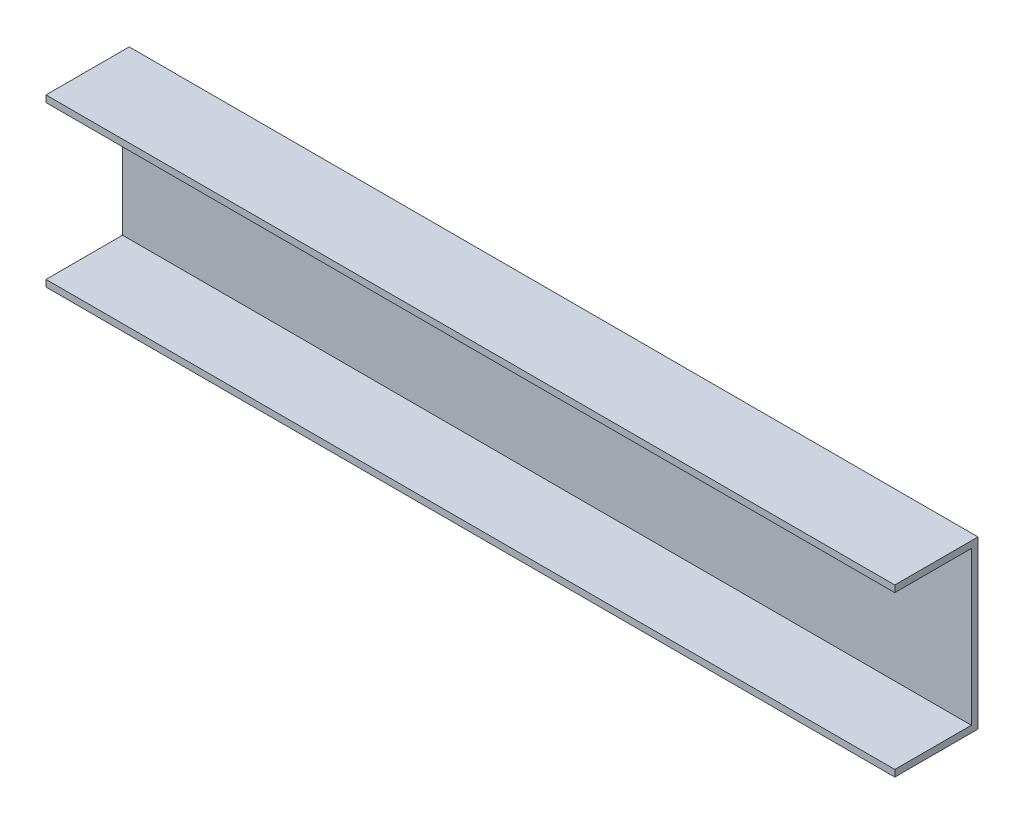
ISO-10303-21;
HEADER;
FILE_DESCRIPTION(('STEP AP214'),'2;1');
FILE_NAME('part.step','',(''),(''),'','','');
FILE_SCHEMA(('AUTOMOTIVE_DESIGN { 1 0 10303 214 1 1 1 1 }'));
ENDSEC;
DATA;
#1=APPLICATION_CONTEXT('core data for automotive mechanical design processes');
#2=APPLICATION_PROTOCOL_DEFINITION('international standard','automotive_design',2000,#1);
#3=PRODUCT_CONTEXT('',#1,'mechanical');
#4=PRODUCT('Part','Part','',(#3));
#5=PRODUCT_RELATED_PRODUCT_CATEGORY('part','',(#4));
#6=PRODUCT_DEFINITION_FORMATION('','',#4);
#7=PRODUCT_DEFINITION_CONTEXT('part definition',#1,'design');
#8=PRODUCT_DEFINITION('design','',#6,#7);
#9=PRODUCT_DEFINITION_SHAPE('','',#8);
#10=(LENGTH_UNIT() NAMED_UNIT(*) SI_UNIT(.MILLI.,.METRE.));
#11=(NAMED_UNIT(*) PLANE_ANGLE_UNIT() SI_UNIT($,.RADIAN.));
#12=(NAMED_UNIT(*) SI_UNIT($,.STERADIAN.) SOLID_ANGLE_UNIT());
#13=UNCERTAINTY_MEASURE_WITH_UNIT(LENGTH_MEASURE(1.E-05),#10,'distance_accuracy_value','');
#14=(GEOMETRIC_REPRESENTATION_CONTEXT(3) GLOBAL_UNCERTAINTY_ASSIGNED_CONTEXT((#13)) GLOBAL_UNIT_ASSIGNED_CONTEXT((#10,
#11,#12)) REPRESENTATION_CONTEXT('',''));
#15=CARTESIAN_POINT('',(0.,0.,0.));
#16=DIRECTION('',(0.,0.,1.));
#17=DIRECTION('',(1.,0.,0.));
#18=AXIS2_PLACEMENT_3D('',#15,#16,#17);
#19=CARTESIAN_POINT('',(175.,26.3779527559055,0.));
#20=DIRECTION('',(0.,0.,-1.));
#21=DIRECTION('',(0.,1.,0.));
#22=AXIS2_PLACEMENT_3D('',#19,#20,#21);
#23=PLANE('',#22);
#24=DIRECTION('',(-1.,0.,0.));
#25=VECTOR('',#24,1.);
#26=CARTESIAN_POINT('',(175.,26.3779527559055,0.));
#27=LINE('',#26,#25);
#28=CARTESIAN_POINT('',(175.,26.3779527559055,0.));
#29=VERTEX_POINT('',#28);
#30=CARTESIAN_POINT('',(-80.,26.3779527559055,0.));
#31=VERTEX_POINT('',#30);
#32=EDGE_CURVE('E105',#29,#31,#27,.T.);
#33=ORIENTED_EDGE('',*,*,#32,.T.);
#34=DIRECTION('',(0.,1.,0.));
#35=VECTOR('',#34,1.);
#36=CARTESIAN_POINT('',(-80.,24.3779527559055,0.));
#37=LINE('',#36,#35);
#38=CARTESIAN_POINT('',(-80.,24.3779527559055,0.));
#39=VERTEX_POINT('',#38);
#40=EDGE_CURVE('E109',#39,#31,#37,.T.);
#41=ORIENTED_EDGE('',*,*,#40,.F.);
#42=DIRECTION('',(-1.,0.,0.));
#43=VECTOR('',#42,1.);
#44=CARTESIAN_POINT('',(175.,24.3779527559055,0.));
#45=LINE('',#44,#43);
#46=CARTESIAN_POINT('',(175.,24.3779527559055,0.));
#47=VERTEX_POINT('',#46);
#48=EDGE_CURVE('E11',#47,#39,#45,.T.);
#49=ORIENTED_EDGE('',*,*,#48,.F.);
#50=DIRECTION('',(0.,-1.,0.));
#51=VECTOR('',#50,1.);
#52=CARTESIAN_POINT('',(175.,26.3779527559055,0.));
#53=LINE('',#52,#51);
#54=EDGE_CURVE('E110',#29,#47,#53,.T.);
#55=ORIENTED_EDGE('',*,*,#54,.F.);
#56=EDGE_LOOP('',(#33,#41,#49,#55));
#57=FACE_BOUND('',#56,.T.);
#58=ADVANCED_FACE('F41',(#57),#23,.F.);
#59=CARTESIAN_POINT('',(175.,24.3779527559055,0.));
#60=DIRECTION('',(0.,1.,0.));
#61=DIRECTION('',(0.,0.,1.));
#62=AXIS2_PLACEMENT_3D('',#59,#60,#61);
#63=PLANE('',#62);
#64=ORIENTED_EDGE('',*,*,#48,.T.);
#65=DIRECTION('',(0.,0.,1.));
#66=VECTOR('',#65,1.);
#67=CARTESIAN_POINT('',(-80.,24.3779527559055,-23.));
#68=LINE('',#67,#66);
#69=CARTESIAN_POINT('',(-80.,24.3779527559055,-23.));
#70=VERTEX_POINT('',#69);
#71=EDGE_CURVE('E128',#70,#39,#68,.T.);
#72=ORIENTED_EDGE('',*,*,#71,.F.);
#73=DIRECTION('',(-1.,0.,0.));
#74=VECTOR('',#73,1.);
#75=CARTESIAN_POINT('',(175.,24.3779527559055,-23.));
#76=LINE('',#75,#74);
#77=CARTESIAN_POINT('',(175.,24.3779527559055,-23.));
#78=VERTEX_POINT('',#77);
#79=EDGE_CURVE('E49',#78,#70,#76,.T.);
#80=ORIENTED_EDGE('',*,*,#79,.F.);
#81=DIRECTION('',(0.,0.,-1.));
#82=VECTOR('',#81,1.);
#83=CARTESIAN_POINT('',(175.,24.3779527559055,0.));
#84=LINE('',#83,#82);
#85=EDGE_CURVE('E161',#47,#78,#84,.T.);
#86=ORIENTED_EDGE('',*,*,#85,.F.);
#87=EDGE_LOOP('',(#64,#72,#80,#86));
#88=FACE_BOUND('',#87,.T.);
#89=ADVANCED_FACE('F202',(#88),#63,.F.);
#90=CARTESIAN_POINT('',(175.,24.3779527559055,-23.));
#91=DIRECTION('',(0.,0.,-1.));
#92=DIRECTION('',(0.,1.,0.));
#93=AXIS2_PLACEMENT_3D('',#90,#91,#92);
#94=PLANE('',#93);
#95=CARTESIAN_POINT('',(30.,6.37795275590551,-23.));
#96=DIRECTION('',(0.,0.,-1.));
#97=DIRECTION('',(0.,1.,0.));
#98=AXIS2_PLACEMENT_3D('',#95,#96,#97);
#99=CIRCLE('',#98,2.55);
#100=CARTESIAN_POINT('',(30.,8.92795275590551,-23.));
#101=VERTEX_POINT('',#100);
#102=EDGE_CURVE('E155',#101,#101,#99,.T.);
#103=ORIENTED_EDGE('',*,*,#102,.T.);
#104=EDGE_LOOP('',(#103));
#105=FACE_BOUND('',#104,.T.);
#106=ORIENTED_EDGE('',*,*,#79,.T.);
#107=DIRECTION('',(0.,1.,0.));
#108=VECTOR('',#107,1.);
#109=CARTESIAN_POINT('',(-80.,-21.6220472440945,-23.));
#110=LINE('',#109,#108);
#111=CARTESIAN_POINT('',(-80.,-21.6220472440945,-23.));
#112=VERTEX_POINT('',#111);
#113=EDGE_CURVE('E146',#112,#70,#110,.T.);
#114=ORIENTED_EDGE('',*,*,#113,.F.);
#115=DIRECTION('',(-1.,0.,0.));
#116=VECTOR('',#115,1.);
#117=CARTESIAN_POINT('',(175.,-21.6220472440945,-23.));
#118=LINE('',#117,#116);
#119=CARTESIAN_POINT('',(175.,-21.6220472440945,-23.));
#120=VERTEX_POINT('',#119);
#121=EDGE_CURVE('E191',#120,#112,#118,.T.);
#122=ORIENTED_EDGE('',*,*,#121,.F.);
#123=DIRECTION('',(0.,-1.,0.));
#124=VECTOR('',#123,1.);
#125=CARTESIAN_POINT('',(175.,24.3779527559055,-23.));
#126=LINE('',#125,#124);
#127=EDGE_CURVE('E164',#78,#120,#126,.T.);
#128=ORIENTED_EDGE('',*,*,#127,.F.);
#129=EDGE_LOOP('',(#106,#114,#122,#128));
#130=FACE_BOUND('',#129,.T.);
#131=ADVANCED_FACE('F198',(#105,#130),#94,.F.);
#132=CARTESIAN_POINT('',(175.,-21.6220472440945,-23.));
#133=DIRECTION('',(0.,-1.,0.));
#134=DIRECTION('',(0.,0.,-1.));
#135=AXIS2_PLACEMENT_3D('',#132,#133,#134);
#136=PLANE('',#135);
#137=ORIENTED_EDGE('',*,*,#121,.T.);
#138=DIRECTION('',(0.,0.,-1.));
#139=VECTOR('',#138,1.);
#140=CARTESIAN_POINT('',(-80.,-21.6220472440945,0.));
#141=LINE('',#140,#139);
#142=CARTESIAN_POINT('',(-80.,-21.6220472440945,0.));
#143=VERTEX_POINT('',#142);
#144=EDGE_CURVE('E142',#143,#112,#141,.T.);
#145=ORIENTED_EDGE('',*,*,#144,.F.);
#146=DIRECTION('',(-1.,0.,0.));
#147=VECTOR('',#146,1.);
#148=CARTESIAN_POINT('',(175.,-21.6220472440945,0.));
#149=LINE('',#148,#147);
#150=CARTESIAN_POINT('',(175.,-21.6220472440945,0.));
#151=VERTEX_POINT('',#150);
#152=EDGE_CURVE('E188',#151,#143,#149,.T.);
#153=ORIENTED_EDGE('',*,*,#152,.F.);
#154=DIRECTION('',(0.,0.,1.));
#155=VECTOR('',#154,1.);
#156=CARTESIAN_POINT('',(175.,-21.6220472440945,-23.));
#157=LINE('',#156,#155);
#158=EDGE_CURVE('E167',#120,#151,#157,.T.);
#159=ORIENTED_EDGE('',*,*,#158,.F.);
#160=EDGE_LOOP('',(#137,#145,#153,#159));
#161=FACE_BOUND('',#160,.T.);
#162=ADVANCED_FACE('F222',(#161),#136,.F.);
#163=CARTESIAN_POINT('',(175.,-21.6220472440945,0.));
#164=DIRECTION('',(0.,0.,-1.));
#165=DIRECTION('',(0.,1.,0.));
#166=AXIS2_PLACEMENT_3D('',#163,#164,#165);
#167=PLANE('',#166);
#168=ORIENTED_EDGE('',*,*,#152,.T.);
#169=DIRECTION('',(0.,1.,0.));
#170=VECTOR('',#169,1.);
#171=CARTESIAN_POINT('',(-80.,-23.6220472440945,0.));
#172=LINE('',#171,#170);
#173=CARTESIAN_POINT('',(-80.,-23.6220472440945,0.));
#174=VERTEX_POINT('',#173);
#175=EDGE_CURVE('E138',#174,#143,#172,.T.);
#176=ORIENTED_EDGE('',*,*,#175,.F.);
#177=DIRECTION('',(-1.,0.,0.));
#178=VECTOR('',#177,1.);
#179=CARTESIAN_POINT('',(175.,-23.6220472440945,0.));
#180=LINE('',#179,#178);
#181=CARTESIAN_POINT('',(175.,-23.6220472440945,0.));
#182=VERTEX_POINT('',#181);
#183=EDGE_CURVE('E185',#182,#174,#180,.T.);
#184=ORIENTED_EDGE('',*,*,#183,.F.);
#185=DIRECTION('',(0.,-1.,0.));
#186=VECTOR('',#185,1.);
#187=CARTESIAN_POINT('',(175.,-21.6220472440945,0.));
#188=LINE('',#187,#186);
#189=EDGE_CURVE('E170',#151,#182,#188,.T.);
#190=ORIENTED_EDGE('',*,*,#189,.F.);
#191=EDGE_LOOP('',(#168,#176,#184,#190));
#192=FACE_BOUND('',#191,.T.);
#193=ADVANCED_FACE('F228',(#192),#167,.F.);
#194=CARTESIAN_POINT('',(175.,-23.6220472440945,0.));
#195=DIRECTION('',(0.,1.,0.));
#196=DIRECTION('',(0.,0.,1.));
#197=AXIS2_PLACEMENT_3D('',#194,#195,#196);
#198=PLANE('',#197);
#199=ORIENTED_EDGE('',*,*,#183,.T.);
#200=DIRECTION('',(0.,0.,1.));
#201=VECTOR('',#200,1.);
#202=CARTESIAN_POINT('',(-80.,-23.6220472440945,-25.));
#203=LINE('',#202,#201);
#204=CARTESIAN_POINT('',(-80.,-23.6220472440945,-25.));
#205=VERTEX_POINT('',#204);
#206=EDGE_CURVE('E134',#205,#174,#203,.T.);
#207=ORIENTED_EDGE('',*,*,#206,.F.);
#208=DIRECTION('',(-1.,0.,0.));
#209=VECTOR('',#208,1.);
#210=CARTESIAN_POINT('',(175.,-23.6220472440945,-25.));
#211=LINE('',#210,#209);
#212=CARTESIAN_POINT('',(175.,-23.6220472440945,-25.));
#213=VERTEX_POINT('',#212);
#214=EDGE_CURVE('E182',#213,#205,#211,.T.);
#215=ORIENTED_EDGE('',*,*,#214,.F.);
#216=DIRECTION('',(0.,0.,-1.));
#217=VECTOR('',#216,1.);
#218=CARTESIAN_POINT('',(175.,-23.6220472440945,0.));
#219=LINE('',#218,#217);
#220=EDGE_CURVE('E173',#182,#213,#219,.T.);
#221=ORIENTED_EDGE('',*,*,#220,.F.);
#222=EDGE_LOOP('',(#199,#207,#215,#221));
#223=FACE_BOUND('',#222,.T.);
#224=ADVANCED_FACE('F232',(#223),#198,.F.);
#225=CARTESIAN_POINT('',(175.,26.3779527559055,-25.));
#226=DIRECTION('',(0.,0.,1.));
#227=DIRECTION('',(0.,-1.,0.));
#228=AXIS2_PLACEMENT_3D('',#225,#226,#227);
#229=PLANE('',#228);
#230=CARTESIAN_POINT('',(30.,6.37795275590551,-25.));
#231=DIRECTION('',(0.,0.,-1.));
#232=DIRECTION('',(-1.,0.,0.));
#233=AXIS2_PLACEMENT_3D('',#230,#231,#232);
#234=CIRCLE('',#233,2.55);
#235=CARTESIAN_POINT('',(27.45,6.37795275590551,-25.));
#236=VERTEX_POINT('',#235);
#237=EDGE_CURVE('E151',#236,#236,#234,.T.);
#238=ORIENTED_EDGE('',*,*,#237,.F.);
#239=EDGE_LOOP('',(#238));
#240=FACE_BOUND('',#239,.T.);
#241=ORIENTED_EDGE('',*,*,#214,.T.);
#242=DIRECTION('',(0.,-1.,0.));
#243=VECTOR('',#242,1.);
#244=CARTESIAN_POINT('',(-80.,26.3779527559055,-25.));
#245=LINE('',#244,#243);
#246=CARTESIAN_POINT('',(-80.,26.3779527559055,-25.));
#247=VERTEX_POINT('',#246);
#248=EDGE_CURVE('E122',#247,#205,#245,.T.);
#249=ORIENTED_EDGE('',*,*,#248,.F.);
#250=DIRECTION('',(-1.,0.,0.));
#251=VECTOR('',#250,1.);
#252=CARTESIAN_POINT('',(175.,26.3779527559055,-25.));
#253=LINE('',#252,#251);
#254=CARTESIAN_POINT('',(175.,26.3779527559055,-25.));
#255=VERTEX_POINT('',#254);
#256=EDGE_CURVE('E113',#255,#247,#253,.T.);
#257=ORIENTED_EDGE('',*,*,#256,.F.);
#258=DIRECTION('',(0.,1.,0.));
#259=VECTOR('',#258,1.);
#260=CARTESIAN_POINT('',(175.,26.3779527559055,-25.));
#261=LINE('',#260,#259);
#262=EDGE_CURVE('E61',#213,#255,#261,.T.);
#263=ORIENTED_EDGE('',*,*,#262,.F.);
#264=EDGE_LOOP('',(#241,#249,#257,#263));
#265=FACE_BOUND('',#264,.T.);
#266=ADVANCED_FACE('F213',(#240,#265),#229,.F.);
#267=CARTESIAN_POINT('',(175.,26.3779527559055,0.));
#268=DIRECTION('',(0.,-1.,0.));
#269=DIRECTION('',(0.,0.,-1.));
#270=AXIS2_PLACEMENT_3D('',#267,#268,#269);
#271=PLANE('',#270);
#272=ORIENTED_EDGE('',*,*,#256,.T.);
#273=DIRECTION('',(0.,0.,-1.));
#274=VECTOR('',#273,1.);
#275=CARTESIAN_POINT('',(-80.,26.3779527559055,0.));
#276=LINE('',#275,#274);
#277=EDGE_CURVE('E116',#31,#247,#276,.T.);
#278=ORIENTED_EDGE('',*,*,#277,.F.);
#279=ORIENTED_EDGE('',*,*,#32,.F.);
#280=DIRECTION('',(0.,0.,1.));
#281=VECTOR('',#280,1.);
#282=CARTESIAN_POINT('',(175.,26.3779527559055,0.));
#283=LINE('',#282,#281);
#284=EDGE_CURVE('E56',#255,#29,#283,.T.);
#285=ORIENTED_EDGE('',*,*,#284,.F.);
#286=EDGE_LOOP('',(#272,#278,#279,#285));
#287=FACE_BOUND('',#286,.T.);
#288=ADVANCED_FACE('F117',(#287),#271,.F.);
#289=CARTESIAN_POINT('',(175.,0.,0.));
#290=DIRECTION('',(1.,0.,0.));
#291=DIRECTION('',(0.,0.,-1.));
#292=AXIS2_PLACEMENT_3D('',#289,#290,#291);
#293=PLANE('',#292);
#294=ORIENTED_EDGE('',*,*,#54,.T.);
#295=ORIENTED_EDGE('',*,*,#85,.T.);
#296=ORIENTED_EDGE('',*,*,#127,.T.);
#297=ORIENTED_EDGE('',*,*,#158,.T.);
#298=ORIENTED_EDGE('',*,*,#189,.T.);
#299=ORIENTED_EDGE('',*,*,#220,.T.);
#300=ORIENTED_EDGE('',*,*,#262,.T.);
#301=ORIENTED_EDGE('',*,*,#284,.T.);
#302=EDGE_LOOP('',(#294,#295,#296,#297,#298,#299,#300,#301));
#303=FACE_BOUND('',#302,.T.);
#304=ADVANCED_FACE('F203',(#303),#293,.T.);
#305=CARTESIAN_POINT('',(30.,6.37795275590551,355.));
#306=DIRECTION('',(0.,0.,-1.));
#307=DIRECTION('',(-1.,0.,0.));
#308=AXIS2_PLACEMENT_3D('',#305,#306,#307);
#309=CYLINDRICAL_SURFACE('',#308,2.55);
#310=ORIENTED_EDGE('',*,*,#237,.T.);
#311=EDGE_LOOP('',(#310));
#312=FACE_BOUND('',#311,.T.);
#313=ORIENTED_EDGE('',*,*,#102,.F.);
#314=EDGE_LOOP('',(#313));
#315=FACE_BOUND('',#314,.T.);
#316=ADVANCED_FACE('F205',(#312,#315),#309,.F.);
#317=CARTESIAN_POINT('',(-80.,0.,0.));
#318=DIRECTION('',(-1.,0.,0.));
#319=DIRECTION('',(0.,0.,1.));
#320=AXIS2_PLACEMENT_3D('',#317,#318,#319);
#321=PLANE('',#320);
#322=ORIENTED_EDGE('',*,*,#40,.T.);
#323=ORIENTED_EDGE('',*,*,#277,.T.);
#324=ORIENTED_EDGE('',*,*,#248,.T.);
#325=ORIENTED_EDGE('',*,*,#206,.T.);
#326=ORIENTED_EDGE('',*,*,#175,.T.);
#327=ORIENTED_EDGE('',*,*,#144,.T.);
#328=ORIENTED_EDGE('',*,*,#113,.T.);
#329=ORIENTED_EDGE('',*,*,#71,.T.);
#330=EDGE_LOOP('',(#322,#323,#324,#325,#326,#327,#328,#329));
#331=FACE_BOUND('',#330,.T.);
#332=ADVANCED_FACE('F125',(#331),#321,.T.);
#333=CLOSED_SHELL('',(#58,#89,#131,#162,#193,#224,#266,#288,#304,#316,#332));
#334=MANIFOLD_SOLID_BREP('B2',#333);
#335=ADVANCED_BREP_SHAPE_REPRESENTATION('',(#18,#334),#14);
#336=SHAPE_DEFINITION_REPRESENTATION(#9,#335);
ENDSEC;
END-ISO-10303-21;
